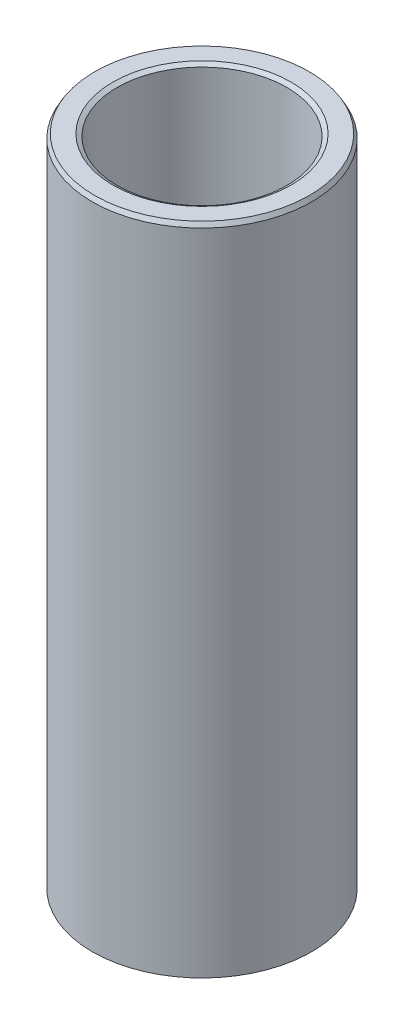
ISO-10303-21;
HEADER;
FILE_DESCRIPTION(('STEP AP214'),'2;1');
FILE_NAME('part.step','',(''),(''),'','','');
FILE_SCHEMA(('AUTOMOTIVE_DESIGN { 1 0 10303 214 1 1 1 1 }'));
ENDSEC;
DATA;
#1=APPLICATION_CONTEXT('core data for automotive mechanical design processes');
#2=APPLICATION_PROTOCOL_DEFINITION('international standard','automotive_design',2000,#1);
#3=PRODUCT_CONTEXT('',#1,'mechanical');
#4=PRODUCT('Part','Part','',(#3));
#5=PRODUCT_RELATED_PRODUCT_CATEGORY('part','',(#4));
#6=PRODUCT_DEFINITION_FORMATION('','',#4);
#7=PRODUCT_DEFINITION_CONTEXT('part definition',#1,'design');
#8=PRODUCT_DEFINITION('design','',#6,#7);
#9=PRODUCT_DEFINITION_SHAPE('','',#8);
#10=(LENGTH_UNIT() NAMED_UNIT(*) SI_UNIT(.MILLI.,.METRE.));
#11=(NAMED_UNIT(*) PLANE_ANGLE_UNIT() SI_UNIT($,.RADIAN.));
#12=(NAMED_UNIT(*) SI_UNIT($,.STERADIAN.) SOLID_ANGLE_UNIT());
#13=UNCERTAINTY_MEASURE_WITH_UNIT(LENGTH_MEASURE(1.E-05),#10,'distance_accuracy_value','');
#14=(GEOMETRIC_REPRESENTATION_CONTEXT(3) GLOBAL_UNCERTAINTY_ASSIGNED_CONTEXT((#13)) GLOBAL_UNIT_ASSIGNED_CONTEXT((#10,
#11,#12)) REPRESENTATION_CONTEXT('',''));
#15=CARTESIAN_POINT('',(0.,0.,0.));
#16=DIRECTION('',(0.,0.,1.));
#17=DIRECTION('',(1.,0.,0.));
#18=AXIS2_PLACEMENT_3D('',#15,#16,#17);
#19=CARTESIAN_POINT('',(0.,269.056557652256,0.));
#20=DIRECTION('',(0.,-1.,0.));
#21=DIRECTION('',(0.,0.,-1.));
#22=AXIS2_PLACEMENT_3D('',#19,#20,#21);
#23=CYLINDRICAL_SURFACE('',#22,45.);
#24=CARTESIAN_POINT('',(0.,1.00586518326845,0.));
#25=DIRECTION('',(0.,1.,0.));
#26=DIRECTION('',(0.,0.,1.));
#27=AXIS2_PLACEMENT_3D('',#24,#25,#26);
#28=CIRCLE('',#27,45.);
#29=CARTESIAN_POINT('',(0.,1.00586518326845,45.));
#30=VERTEX_POINT('',#29);
#31=EDGE_CURVE('E10',#30,#30,#28,.T.);
#32=ORIENTED_EDGE('',*,*,#31,.T.);
#33=EDGE_LOOP('',(#32));
#34=FACE_BOUND('',#33,.T.);
#35=CARTESIAN_POINT('',(0.,267.31434804927,0.));
#36=DIRECTION('',(0.,1.,0.));
#37=DIRECTION('',(0.,0.,1.));
#38=AXIS2_PLACEMENT_3D('',#35,#36,#37);
#39=CIRCLE('',#38,45.);
#40=CARTESIAN_POINT('',(0.,267.31434804927,45.));
#41=VERTEX_POINT('',#40);
#42=EDGE_CURVE('E50',#41,#41,#39,.F.);
#43=ORIENTED_EDGE('',*,*,#42,.T.);
#44=EDGE_LOOP('',(#43));
#45=FACE_BOUND('',#44,.T.);
#46=ADVANCED_FACE('F39',(#34,#45),#23,.T.);
#47=CARTESIAN_POINT('',(0.,269.056557652256,0.));
#48=DIRECTION('',(0.,1.,0.));
#49=DIRECTION('',(0.,0.,1.));
#50=AXIS2_PLACEMENT_3D('',#47,#48,#49);
#51=PLANE('',#50);
#52=CARTESIAN_POINT('',(0.,269.056557652256,0.));
#53=DIRECTION('',(0.,1.,0.));
#54=DIRECTION('',(0.,0.,1.));
#55=AXIS2_PLACEMENT_3D('',#52,#53,#54);
#56=CIRCLE('',#55,36.5722732930892);
#57=CARTESIAN_POINT('',(0.,269.056557652256,36.5722732930892));
#58=VERTEX_POINT('',#57);
#59=EDGE_CURVE('E58',#58,#58,#56,.F.);
#60=ORIENTED_EDGE('',*,*,#59,.T.);
#61=EDGE_LOOP('',(#60));
#62=FACE_BOUND('',#61,.T.);
#63=CARTESIAN_POINT('',(0.,269.056557652256,0.));
#64=DIRECTION('',(0.,1.,0.));
#65=DIRECTION('',(0.,0.,1.));
#66=AXIS2_PLACEMENT_3D('',#63,#64,#65);
#67=CIRCLE('',#66,43.9941348167315);
#68=CARTESIAN_POINT('',(0.,269.056557652256,43.9941348167315));
#69=VERTEX_POINT('',#68);
#70=EDGE_CURVE('E61',#69,#69,#67,.T.);
#71=ORIENTED_EDGE('',*,*,#70,.T.);
#72=EDGE_LOOP('',(#71));
#73=FACE_BOUND('',#72,.T.);
#74=ADVANCED_FACE('F88',(#62,#73),#51,.T.);
#75=CARTESIAN_POINT('',(0.,0.,0.));
#76=DIRECTION('',(0.,1.,0.));
#77=DIRECTION('',(0.,0.,1.));
#78=AXIS2_PLACEMENT_3D('',#75,#76,#77);
#79=PLANE('',#78);
#80=CARTESIAN_POINT('',(0.,0.,0.));
#81=DIRECTION('',(0.,1.,0.));
#82=DIRECTION('',(0.,0.,1.));
#83=AXIS2_PLACEMENT_3D('',#80,#81,#82);
#84=CIRCLE('',#83,35.835928873372);
#85=CARTESIAN_POINT('',(0.,0.,35.835928873372));
#86=VERTEX_POINT('',#85);
#87=EDGE_CURVE('E51',#86,#86,#84,.T.);
#88=ORIENTED_EDGE('',*,*,#87,.T.);
#89=EDGE_LOOP('',(#88));
#90=FACE_BOUND('',#89,.T.);
#91=CARTESIAN_POINT('',(0.,0.,0.));
#92=DIRECTION('',(0.,1.,0.));
#93=DIRECTION('',(0.,0.,1.));
#94=AXIS2_PLACEMENT_3D('',#91,#92,#93);
#95=CIRCLE('',#94,43.2577903970144);
#96=CARTESIAN_POINT('',(0.,0.,43.2577903970144));
#97=VERTEX_POINT('',#96);
#98=EDGE_CURVE('E54',#97,#97,#95,.F.);
#99=ORIENTED_EDGE('',*,*,#98,.T.);
#100=EDGE_LOOP('',(#99));
#101=FACE_BOUND('',#100,.T.);
#102=ADVANCED_FACE('F83',(#90,#101),#79,.F.);
#103=CARTESIAN_POINT('',(0.,269.056557652256,0.));
#104=DIRECTION('',(0.,-1.,0.));
#105=DIRECTION('',(0.,0.,-1.));
#106=AXIS2_PLACEMENT_3D('',#103,#104,#105);
#107=CYLINDRICAL_SURFACE('',#106,34.8300636901036);
#108=CARTESIAN_POINT('',(0.,268.050692468987,0.));
#109=DIRECTION('',(0.,1.,0.));
#110=DIRECTION('',(0.,0.,1.));
#111=AXIS2_PLACEMENT_3D('',#108,#109,#110);
#112=CIRCLE('',#111,34.8300636901036);
#113=CARTESIAN_POINT('',(0.,268.050692468987,34.8300636901036));
#114=VERTEX_POINT('',#113);
#115=EDGE_CURVE('E67',#114,#114,#112,.T.);
#116=ORIENTED_EDGE('',*,*,#115,.T.);
#117=EDGE_LOOP('',(#116));
#118=FACE_BOUND('',#117,.T.);
#119=CARTESIAN_POINT('',(0.,1.74220960298554,0.));
#120=DIRECTION('',(0.,1.,0.));
#121=DIRECTION('',(0.,0.,1.));
#122=AXIS2_PLACEMENT_3D('',#119,#120,#121);
#123=CIRCLE('',#122,34.8300636901036);
#124=CARTESIAN_POINT('',(0.,1.74220960298554,34.8300636901036));
#125=VERTEX_POINT('',#124);
#126=EDGE_CURVE('E69',#125,#125,#123,.F.);
#127=ORIENTED_EDGE('',*,*,#126,.T.);
#128=EDGE_LOOP('',(#127));
#129=FACE_BOUND('',#128,.T.);
#130=ADVANCED_FACE('F71',(#118,#129),#107,.F.);
#131=CARTESIAN_POINT('',(0.,268.050692468987,0.));
#132=DIRECTION('',(0.,1.,0.));
#133=DIRECTION('',(0.,0.,1.));
#134=AXIS2_PLACEMENT_3D('',#131,#132,#133);
#135=CONICAL_SURFACE('',#134,34.8300636901036,1.04719755119658);
#136=ORIENTED_EDGE('',*,*,#59,.F.);
#137=EDGE_LOOP('',(#136));
#138=FACE_BOUND('',#137,.T.);
#139=ORIENTED_EDGE('',*,*,#115,.F.);
#140=EDGE_LOOP('',(#139));
#141=FACE_BOUND('',#140,.T.);
#142=ADVANCED_FACE('F77',(#138,#141),#135,.F.);
#143=CARTESIAN_POINT('',(0.,0.,0.));
#144=DIRECTION('',(0.,-1.,0.));
#145=DIRECTION('',(0.,0.,-1.));
#146=AXIS2_PLACEMENT_3D('',#143,#144,#145);
#147=CONICAL_SURFACE('',#146,35.835928873372,0.523598775598297);
#148=ORIENTED_EDGE('',*,*,#126,.F.);
#149=EDGE_LOOP('',(#148));
#150=FACE_BOUND('',#149,.T.);
#151=ORIENTED_EDGE('',*,*,#87,.F.);
#152=EDGE_LOOP('',(#151));
#153=FACE_BOUND('',#152,.T.);
#154=ADVANCED_FACE('F73',(#150,#153),#147,.F.);
#155=CARTESIAN_POINT('',(0.,1.00586518326845,0.));
#156=DIRECTION('',(0.,1.,0.));
#157=DIRECTION('',(0.,0.,1.));
#158=AXIS2_PLACEMENT_3D('',#155,#156,#157);
#159=CONICAL_SURFACE('',#158,45.,1.04719755119661);
#160=ORIENTED_EDGE('',*,*,#98,.F.);
#161=EDGE_LOOP('',(#160));
#162=FACE_BOUND('',#161,.T.);
#163=ORIENTED_EDGE('',*,*,#31,.F.);
#164=EDGE_LOOP('',(#163));
#165=FACE_BOUND('',#164,.T.);
#166=ADVANCED_FACE('F76',(#162,#165),#159,.T.);
#167=CARTESIAN_POINT('',(0.,269.056557652256,0.));
#168=DIRECTION('',(0.,-1.,0.));
#169=DIRECTION('',(0.,0.,-1.));
#170=AXIS2_PLACEMENT_3D('',#167,#168,#169);
#171=CONICAL_SURFACE('',#170,43.9941348167315,0.523598775598304);
#172=ORIENTED_EDGE('',*,*,#42,.F.);
#173=EDGE_LOOP('',(#172));
#174=FACE_BOUND('',#173,.T.);
#175=ORIENTED_EDGE('',*,*,#70,.F.);
#176=EDGE_LOOP('',(#175));
#177=FACE_BOUND('',#176,.T.);
#178=ADVANCED_FACE('F45',(#174,#177),#171,.T.);
#179=CLOSED_SHELL('',(#46,#74,#102,#130,#142,#154,#166,#178));
#180=MANIFOLD_SOLID_BREP('B2',#179);
#181=ADVANCED_BREP_SHAPE_REPRESENTATION('',(#18,#180),#14);
#182=SHAPE_DEFINITION_REPRESENTATION(#9,#181);
ENDSEC;
END-ISO-10303-21;
